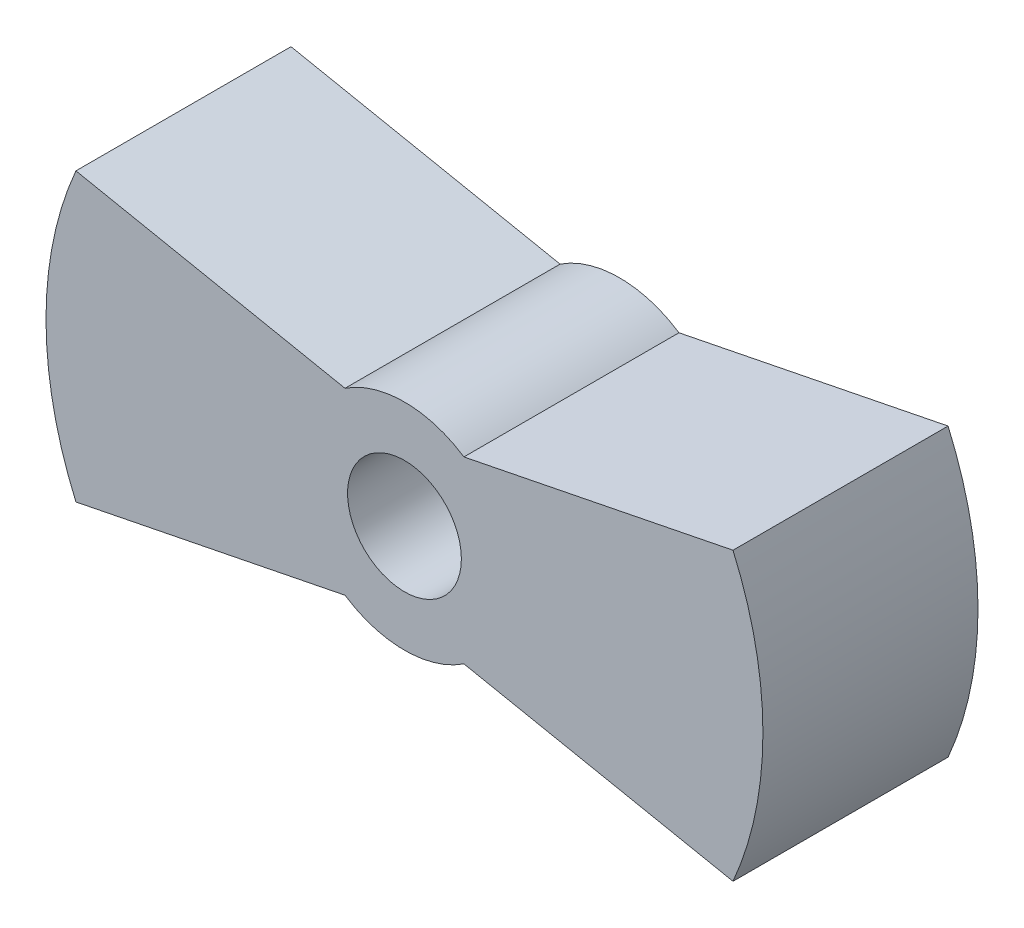
ISO-10303-21;
HEADER;
FILE_DESCRIPTION(('STEP AP214'),'2;1');
FILE_NAME('part.step','',(''),(''),'','','');
FILE_SCHEMA(('AUTOMOTIVE_DESIGN { 1 0 10303 214 1 1 1 1 }'));
ENDSEC;
DATA;
#1=APPLICATION_CONTEXT('core data for automotive mechanical design processes');
#2=APPLICATION_PROTOCOL_DEFINITION('international standard','automotive_design',2000,#1);
#3=PRODUCT_CONTEXT('',#1,'mechanical');
#4=PRODUCT('Part','Part','',(#3));
#5=PRODUCT_RELATED_PRODUCT_CATEGORY('part','',(#4));
#6=PRODUCT_DEFINITION_FORMATION('','',#4);
#7=PRODUCT_DEFINITION_CONTEXT('part definition',#1,'design');
#8=PRODUCT_DEFINITION('design','',#6,#7);
#9=PRODUCT_DEFINITION_SHAPE('','',#8);
#10=(LENGTH_UNIT() NAMED_UNIT(*) SI_UNIT(.MILLI.,.METRE.));
#11=(NAMED_UNIT(*) PLANE_ANGLE_UNIT() SI_UNIT($,.RADIAN.));
#12=(NAMED_UNIT(*) SI_UNIT($,.STERADIAN.) SOLID_ANGLE_UNIT());
#13=UNCERTAINTY_MEASURE_WITH_UNIT(LENGTH_MEASURE(1.E-05),#10,'distance_accuracy_value','');
#14=(GEOMETRIC_REPRESENTATION_CONTEXT(3) GLOBAL_UNCERTAINTY_ASSIGNED_CONTEXT((#13)) GLOBAL_UNIT_ASSIGNED_CONTEXT((#10,
#11,#12)) REPRESENTATION_CONTEXT('',''));
#15=CARTESIAN_POINT('',(0.,0.,0.));
#16=DIRECTION('',(0.,0.,1.));
#17=DIRECTION('',(1.,0.,0.));
#18=AXIS2_PLACEMENT_3D('',#15,#16,#17);
#19=CARTESIAN_POINT('',(0.416695336637559,2.08537653466309,6.));
#20=DIRECTION('',(-0.195944329277329,-0.980615021210698,0.));
#21=DIRECTION('',(0.980615021210698,-0.195944329277329,0.));
#22=AXIS2_PLACEMENT_3D('',#19,#20,#21);
#23=PLANE('',#22);
#24=DIRECTION('',(-0.980615021210698,0.195944329277329,0.));
#25=VECTOR('',#24,1.);
#26=CARTESIAN_POINT('',(0.416695336637559,2.08537653466309,0.));
#27=LINE('',#26,#25);
#28=CARTESIAN_POINT('',(-1.6583123951777,2.5,0.));
#29=VERTEX_POINT('',#28);
#30=CARTESIAN_POINT('',(-9.16515138991168,4.,0.));
#31=VERTEX_POINT('',#30);
#32=EDGE_CURVE('E144',#29,#31,#27,.T.);
#33=ORIENTED_EDGE('',*,*,#32,.T.);
#34=DIRECTION('',(0.,0.,-1.));
#35=VECTOR('',#34,1.);
#36=CARTESIAN_POINT('',(-9.16515138991168,4.,6.));
#37=LINE('',#36,#35);
#38=CARTESIAN_POINT('',(-9.16515138991168,4.,6.));
#39=VERTEX_POINT('',#38);
#40=EDGE_CURVE('E11',#39,#31,#37,.T.);
#41=ORIENTED_EDGE('',*,*,#40,.F.);
#42=DIRECTION('',(-0.980615021210698,0.195944329277329,0.));
#43=VECTOR('',#42,1.);
#44=CARTESIAN_POINT('',(0.416695336637559,2.08537653466309,6.));
#45=LINE('',#44,#43);
#46=CARTESIAN_POINT('',(-1.6583123951777,2.5,6.));
#47=VERTEX_POINT('',#46);
#48=EDGE_CURVE('E164',#47,#39,#45,.T.);
#49=ORIENTED_EDGE('',*,*,#48,.F.);
#50=DIRECTION('',(0.,0.,-1.));
#51=VECTOR('',#50,1.);
#52=CARTESIAN_POINT('',(-1.6583123951777,2.5,6.));
#53=LINE('',#52,#51);
#54=EDGE_CURVE('E143',#47,#29,#53,.T.);
#55=ORIENTED_EDGE('',*,*,#54,.T.);
#56=EDGE_LOOP('',(#33,#41,#49,#55));
#57=FACE_BOUND('',#56,.T.);
#58=ADVANCED_FACE('F40',(#57),#23,.F.);
#59=CARTESIAN_POINT('',(0.,0.,6.));
#60=DIRECTION('',(0.,0.,-1.));
#61=DIRECTION('',(-1.,0.,0.));
#62=AXIS2_PLACEMENT_3D('',#59,#60,#61);
#63=CYLINDRICAL_SURFACE('',#62,10.);
#64=CARTESIAN_POINT('',(0.,0.,0.));
#65=DIRECTION('',(0.,0.,1.));
#66=DIRECTION('',(1.,0.,0.));
#67=AXIS2_PLACEMENT_3D('',#64,#65,#66);
#68=CIRCLE('',#67,10.);
#69=CARTESIAN_POINT('',(-9.16515138991168,-4.,0.));
#70=VERTEX_POINT('',#69);
#71=EDGE_CURVE('E147',#31,#70,#68,.T.);
#72=ORIENTED_EDGE('',*,*,#71,.T.);
#73=DIRECTION('',(0.,0.,-1.));
#74=VECTOR('',#73,1.);
#75=CARTESIAN_POINT('',(-9.16515138991168,-4.,6.));
#76=LINE('',#75,#74);
#77=CARTESIAN_POINT('',(-9.16515138991168,-4.,6.));
#78=VERTEX_POINT('',#77);
#79=EDGE_CURVE('E48',#78,#70,#76,.T.);
#80=ORIENTED_EDGE('',*,*,#79,.F.);
#81=CARTESIAN_POINT('',(0.,0.,6.));
#82=DIRECTION('',(0.,0.,1.));
#83=DIRECTION('',(1.,0.,0.));
#84=AXIS2_PLACEMENT_3D('',#81,#82,#83);
#85=CIRCLE('',#84,10.);
#86=EDGE_CURVE('E96',#39,#78,#85,.T.);
#87=ORIENTED_EDGE('',*,*,#86,.F.);
#88=ORIENTED_EDGE('',*,*,#40,.T.);
#89=EDGE_LOOP('',(#72,#80,#87,#88));
#90=FACE_BOUND('',#89,.T.);
#91=ADVANCED_FACE('F178',(#90),#63,.T.);
#92=CARTESIAN_POINT('',(0.416695336637559,-2.08537653466309,6.));
#93=DIRECTION('',(0.195944329277329,-0.980615021210698,0.));
#94=DIRECTION('',(0.980615021210698,0.195944329277329,0.));
#95=AXIS2_PLACEMENT_3D('',#92,#93,#94);
#96=PLANE('',#95);
#97=DIRECTION('',(-0.980615021210698,-0.195944329277329,0.));
#98=VECTOR('',#97,1.);
#99=CARTESIAN_POINT('',(0.416695336637559,-2.08537653466309,0.));
#100=LINE('',#99,#98);
#101=CARTESIAN_POINT('',(-1.6583123951777,-2.5,0.));
#102=VERTEX_POINT('',#101);
#103=EDGE_CURVE('E151',#102,#70,#100,.T.);
#104=ORIENTED_EDGE('',*,*,#103,.F.);
#105=DIRECTION('',(0.,0.,-1.));
#106=VECTOR('',#105,1.);
#107=CARTESIAN_POINT('',(-1.6583123951777,-2.5,6.));
#108=LINE('',#107,#106);
#109=CARTESIAN_POINT('',(-1.6583123951777,-2.5,6.));
#110=VERTEX_POINT('',#109);
#111=EDGE_CURVE('E171',#110,#102,#108,.T.);
#112=ORIENTED_EDGE('',*,*,#111,.F.);
#113=DIRECTION('',(-0.980615021210698,-0.195944329277329,0.));
#114=VECTOR('',#113,1.);
#115=CARTESIAN_POINT('',(0.416695336637559,-2.08537653466309,6.));
#116=LINE('',#115,#114);
#117=EDGE_CURVE('E177',#110,#78,#116,.T.);
#118=ORIENTED_EDGE('',*,*,#117,.T.);
#119=ORIENTED_EDGE('',*,*,#79,.T.);
#120=EDGE_LOOP('',(#104,#112,#118,#119));
#121=FACE_BOUND('',#120,.T.);
#122=ADVANCED_FACE('F175',(#121),#96,.T.);
#123=CARTESIAN_POINT('',(0.,0.,6.));
#124=DIRECTION('',(0.,0.,-1.));
#125=DIRECTION('',(-1.,0.,0.));
#126=AXIS2_PLACEMENT_3D('',#123,#124,#125);
#127=CYLINDRICAL_SURFACE('',#126,3.);
#128=CARTESIAN_POINT('',(0.,0.,0.));
#129=DIRECTION('',(0.,0.,1.));
#130=DIRECTION('',(1.,0.,0.));
#131=AXIS2_PLACEMENT_3D('',#128,#129,#130);
#132=CIRCLE('',#131,3.);
#133=CARTESIAN_POINT('',(1.6583123951777,-2.5,0.));
#134=VERTEX_POINT('',#133);
#135=EDGE_CURVE('E154',#102,#134,#132,.T.);
#136=ORIENTED_EDGE('',*,*,#135,.T.);
#137=DIRECTION('',(0.,0.,-1.));
#138=VECTOR('',#137,1.);
#139=CARTESIAN_POINT('',(1.6583123951777,-2.5,6.));
#140=LINE('',#139,#138);
#141=CARTESIAN_POINT('',(1.6583123951777,-2.5,6.));
#142=VERTEX_POINT('',#141);
#143=EDGE_CURVE('E168',#142,#134,#140,.T.);
#144=ORIENTED_EDGE('',*,*,#143,.F.);
#145=CARTESIAN_POINT('',(0.,0.,6.));
#146=DIRECTION('',(0.,0.,1.));
#147=DIRECTION('',(1.,0.,0.));
#148=AXIS2_PLACEMENT_3D('',#145,#146,#147);
#149=CIRCLE('',#148,3.);
#150=EDGE_CURVE('E138',#110,#142,#149,.T.);
#151=ORIENTED_EDGE('',*,*,#150,.F.);
#152=ORIENTED_EDGE('',*,*,#111,.T.);
#153=EDGE_LOOP('',(#136,#144,#151,#152));
#154=FACE_BOUND('',#153,.T.);
#155=ADVANCED_FACE('F188',(#154),#127,.T.);
#156=CARTESIAN_POINT('',(-0.416695336637559,-2.08537653466309,6.));
#157=DIRECTION('',(0.195944329277329,0.980615021210698,0.));
#158=DIRECTION('',(-0.980615021210698,0.195944329277329,0.));
#159=AXIS2_PLACEMENT_3D('',#156,#157,#158);
#160=PLANE('',#159);
#161=DIRECTION('',(0.980615021210698,-0.195944329277329,0.));
#162=VECTOR('',#161,1.);
#163=CARTESIAN_POINT('',(-0.416695336637559,-2.08537653466309,0.));
#164=LINE('',#163,#162);
#165=CARTESIAN_POINT('',(9.16515138991168,-4.,0.));
#166=VERTEX_POINT('',#165);
#167=EDGE_CURVE('E156',#134,#166,#164,.T.);
#168=ORIENTED_EDGE('',*,*,#167,.T.);
#169=DIRECTION('',(0.,0.,-1.));
#170=VECTOR('',#169,1.);
#171=CARTESIAN_POINT('',(9.16515138991168,-4.,6.));
#172=LINE('',#171,#170);
#173=CARTESIAN_POINT('',(9.16515138991168,-4.,6.));
#174=VERTEX_POINT('',#173);
#175=EDGE_CURVE('E132',#174,#166,#172,.T.);
#176=ORIENTED_EDGE('',*,*,#175,.F.);
#177=DIRECTION('',(0.980615021210698,-0.195944329277329,0.));
#178=VECTOR('',#177,1.);
#179=CARTESIAN_POINT('',(-0.416695336637559,-2.08537653466309,6.));
#180=LINE('',#179,#178);
#181=EDGE_CURVE('E119',#142,#174,#180,.T.);
#182=ORIENTED_EDGE('',*,*,#181,.F.);
#183=ORIENTED_EDGE('',*,*,#143,.T.);
#184=EDGE_LOOP('',(#168,#176,#182,#183));
#185=FACE_BOUND('',#184,.T.);
#186=ADVANCED_FACE('F191',(#185),#160,.F.);
#187=CARTESIAN_POINT('',(0.,0.,6.));
#188=DIRECTION('',(0.,0.,-1.));
#189=DIRECTION('',(-1.,0.,0.));
#190=AXIS2_PLACEMENT_3D('',#187,#188,#189);
#191=CYLINDRICAL_SURFACE('',#190,10.);
#192=CARTESIAN_POINT('',(0.,0.,0.));
#193=DIRECTION('',(0.,0.,1.));
#194=DIRECTION('',(1.,0.,0.));
#195=AXIS2_PLACEMENT_3D('',#192,#193,#194);
#196=CIRCLE('',#195,10.);
#197=CARTESIAN_POINT('',(9.16515138991168,4.,0.));
#198=VERTEX_POINT('',#197);
#199=EDGE_CURVE('E128',#166,#198,#196,.T.);
#200=ORIENTED_EDGE('',*,*,#199,.T.);
#201=DIRECTION('',(0.,0.,-1.));
#202=VECTOR('',#201,1.);
#203=CARTESIAN_POINT('',(9.16515138991168,4.,6.));
#204=LINE('',#203,#202);
#205=CARTESIAN_POINT('',(9.16515138991168,4.,6.));
#206=VERTEX_POINT('',#205);
#207=EDGE_CURVE('E125',#206,#198,#204,.T.);
#208=ORIENTED_EDGE('',*,*,#207,.F.);
#209=CARTESIAN_POINT('',(0.,0.,6.));
#210=DIRECTION('',(0.,0.,1.));
#211=DIRECTION('',(1.,0.,0.));
#212=AXIS2_PLACEMENT_3D('',#209,#210,#211);
#213=CIRCLE('',#212,10.);
#214=EDGE_CURVE('E112',#174,#206,#213,.T.);
#215=ORIENTED_EDGE('',*,*,#214,.F.);
#216=ORIENTED_EDGE('',*,*,#175,.T.);
#217=EDGE_LOOP('',(#200,#208,#215,#216));
#218=FACE_BOUND('',#217,.T.);
#219=ADVANCED_FACE('F126',(#218),#191,.T.);
#220=CARTESIAN_POINT('',(-0.416695336637559,2.08537653466309,6.));
#221=DIRECTION('',(-0.195944329277329,0.980615021210698,0.));
#222=DIRECTION('',(-0.980615021210698,-0.195944329277329,0.));
#223=AXIS2_PLACEMENT_3D('',#220,#221,#222);
#224=PLANE('',#223);
#225=DIRECTION('',(0.980615021210698,0.195944329277329,0.));
#226=VECTOR('',#225,1.);
#227=CARTESIAN_POINT('',(-0.416695336637559,2.08537653466309,0.));
#228=LINE('',#227,#226);
#229=CARTESIAN_POINT('',(1.6583123951777,2.5,0.));
#230=VERTEX_POINT('',#229);
#231=EDGE_CURVE('E159',#230,#198,#228,.T.);
#232=ORIENTED_EDGE('',*,*,#231,.F.);
#233=DIRECTION('',(0.,0.,-1.));
#234=VECTOR('',#233,1.);
#235=CARTESIAN_POINT('',(1.6583123951777,2.5,6.));
#236=LINE('',#235,#234);
#237=CARTESIAN_POINT('',(1.6583123951777,2.5,6.));
#238=VERTEX_POINT('',#237);
#239=EDGE_CURVE('E85',#238,#230,#236,.T.);
#240=ORIENTED_EDGE('',*,*,#239,.F.);
#241=DIRECTION('',(0.980615021210698,0.195944329277329,0.));
#242=VECTOR('',#241,1.);
#243=CARTESIAN_POINT('',(-0.416695336637559,2.08537653466309,6.));
#244=LINE('',#243,#242);
#245=EDGE_CURVE('E117',#238,#206,#244,.T.);
#246=ORIENTED_EDGE('',*,*,#245,.T.);
#247=ORIENTED_EDGE('',*,*,#207,.T.);
#248=EDGE_LOOP('',(#232,#240,#246,#247));
#249=FACE_BOUND('',#248,.T.);
#250=ADVANCED_FACE('F134',(#249),#224,.T.);
#251=EDGE_CURVE('E88',#230,#29,#132,.T.);
#252=ORIENTED_EDGE('',*,*,#251,.T.);
#253=ORIENTED_EDGE('',*,*,#54,.F.);
#254=EDGE_CURVE('E56',#238,#47,#149,.T.);
#255=ORIENTED_EDGE('',*,*,#254,.F.);
#256=ORIENTED_EDGE('',*,*,#239,.T.);
#257=EDGE_LOOP('',(#252,#253,#255,#256));
#258=FACE_BOUND('',#257,.T.);
#259=ADVANCED_FACE('F410',(#258),#127,.T.);
#260=CARTESIAN_POINT('',(0.,0.,6.));
#261=DIRECTION('',(0.,0.,-1.));
#262=DIRECTION('',(-1.,0.,0.));
#263=AXIS2_PLACEMENT_3D('',#260,#261,#262);
#264=CYLINDRICAL_SURFACE('',#263,1.5875);
#265=CARTESIAN_POINT('',(0.,0.,6.));
#266=DIRECTION('',(0.,0.,1.));
#267=DIRECTION('',(1.,0.,0.));
#268=AXIS2_PLACEMENT_3D('',#265,#266,#267);
#269=CIRCLE('',#268,1.5875);
#270=CARTESIAN_POINT('',(1.5875,0.,6.));
#271=VERTEX_POINT('',#270);
#272=EDGE_CURVE('E136',#271,#271,#269,.T.);
#273=ORIENTED_EDGE('',*,*,#272,.T.);
#274=EDGE_LOOP('',(#273));
#275=FACE_BOUND('',#274,.T.);
#276=CARTESIAN_POINT('',(0.,0.,0.));
#277=DIRECTION('',(0.,0.,1.));
#278=DIRECTION('',(1.,0.,0.));
#279=AXIS2_PLACEMENT_3D('',#276,#277,#278);
#280=CIRCLE('',#279,1.5875);
#281=CARTESIAN_POINT('',(1.5875,0.,0.));
#282=VERTEX_POINT('',#281);
#283=EDGE_CURVE('E161',#282,#282,#280,.T.);
#284=ORIENTED_EDGE('',*,*,#283,.F.);
#285=EDGE_LOOP('',(#284));
#286=FACE_BOUND('',#285,.T.);
#287=ADVANCED_FACE('F399',(#275,#286),#264,.F.);
#288=CARTESIAN_POINT('',(0.,0.,6.));
#289=DIRECTION('',(0.,0.,1.));
#290=DIRECTION('',(1.,0.,0.));
#291=AXIS2_PLACEMENT_3D('',#288,#289,#290);
#292=PLANE('',#291);
#293=ORIENTED_EDGE('',*,*,#48,.T.);
#294=ORIENTED_EDGE('',*,*,#86,.T.);
#295=ORIENTED_EDGE('',*,*,#117,.F.);
#296=ORIENTED_EDGE('',*,*,#150,.T.);
#297=ORIENTED_EDGE('',*,*,#181,.T.);
#298=ORIENTED_EDGE('',*,*,#214,.T.);
#299=ORIENTED_EDGE('',*,*,#245,.F.);
#300=ORIENTED_EDGE('',*,*,#254,.T.);
#301=EDGE_LOOP('',(#293,#294,#295,#296,#297,#298,#299,#300));
#302=FACE_BOUND('',#301,.T.);
#303=ORIENTED_EDGE('',*,*,#272,.F.);
#304=EDGE_LOOP('',(#303));
#305=FACE_BOUND('',#304,.T.);
#306=ADVANCED_FACE('F114',(#302,#305),#292,.T.);
#307=CARTESIAN_POINT('',(0.,0.,0.));
#308=DIRECTION('',(0.,0.,1.));
#309=DIRECTION('',(1.,0.,0.));
#310=AXIS2_PLACEMENT_3D('',#307,#308,#309);
#311=PLANE('',#310);
#312=ORIENTED_EDGE('',*,*,#32,.F.);
#313=ORIENTED_EDGE('',*,*,#251,.F.);
#314=ORIENTED_EDGE('',*,*,#231,.T.);
#315=ORIENTED_EDGE('',*,*,#199,.F.);
#316=ORIENTED_EDGE('',*,*,#167,.F.);
#317=ORIENTED_EDGE('',*,*,#135,.F.);
#318=ORIENTED_EDGE('',*,*,#103,.T.);
#319=ORIENTED_EDGE('',*,*,#71,.F.);
#320=EDGE_LOOP('',(#312,#313,#314,#315,#316,#317,#318,#319));
#321=FACE_BOUND('',#320,.T.);
#322=ORIENTED_EDGE('',*,*,#283,.T.);
#323=EDGE_LOOP('',(#322));
#324=FACE_BOUND('',#323,.T.);
#325=ADVANCED_FACE('F183',(#321,#324),#311,.F.);
#326=CLOSED_SHELL('',(#58,#91,#122,#155,#186,#219,#250,#259,#287,#306,#325));
#327=CARTESIAN_POINT('',(6.9,0.,3.));
#328=DIRECTION('',(1.,0.,0.));
#329=DIRECTION('',(0.,0.,-1.));
#330=AXIS2_PLACEMENT_3D('',#327,#328,#329);
#331=CYLINDRICAL_SURFACE('',#330,2.1);
#332=CARTESIAN_POINT('',(9.,0.,3.));
#333=DIRECTION('',(1.,0.,0.));
#334=DIRECTION('',(0.,0.,-1.));
#335=AXIS2_PLACEMENT_3D('',#332,#333,#334);
#336=CIRCLE('',#335,2.1);
#337=CARTESIAN_POINT('',(9.,-2.1,3.));
#338=VERTEX_POINT('',#337);
#339=CARTESIAN_POINT('',(9.,2.1,3.));
#340=VERTEX_POINT('',#339);
#341=EDGE_CURVE('E218',#338,#340,#336,.T.);
#342=ORIENTED_EDGE('',*,*,#341,.T.);
#343=DIRECTION('',(1.,0.,0.));
#344=VECTOR('',#343,1.);
#345=CARTESIAN_POINT('',(6.9,2.1,3.));
#346=LINE('',#345,#344);
#347=CARTESIAN_POINT('',(6.9,2.1,3.));
#348=VERTEX_POINT('',#347);
#349=EDGE_CURVE('E196',#348,#340,#346,.T.);
#350=ORIENTED_EDGE('',*,*,#349,.F.);
#351=CARTESIAN_POINT('',(6.9,0.,3.));
#352=DIRECTION('',(1.,0.,0.));
#353=DIRECTION('',(0.,0.,-1.));
#354=AXIS2_PLACEMENT_3D('',#351,#352,#353);
#355=CIRCLE('',#354,2.1);
#356=CARTESIAN_POINT('',(6.9,-2.1,3.));
#357=VERTEX_POINT('',#356);
#358=EDGE_CURVE('E211',#357,#348,#355,.T.);
#359=ORIENTED_EDGE('',*,*,#358,.F.);
#360=DIRECTION('',(1.,0.,0.));
#361=VECTOR('',#360,1.);
#362=CARTESIAN_POINT('',(6.9,-2.1,3.));
#363=LINE('',#362,#361);
#364=EDGE_CURVE('E148',#357,#338,#363,.T.);
#365=ORIENTED_EDGE('',*,*,#364,.T.);
#366=EDGE_LOOP('',(#342,#350,#359,#365));
#367=FACE_BOUND('',#366,.T.);
#368=ADVANCED_FACE('F315',(#367),#331,.F.);
#369=CARTESIAN_POINT('',(6.9,-2.1,5.1));
#370=DIRECTION('',(0.,-1.,0.));
#371=DIRECTION('',(0.,0.,-1.));
#372=AXIS2_PLACEMENT_3D('',#369,#370,#371);
#373=PLANE('',#372);
#374=DIRECTION('',(0.,0.,-1.));
#375=VECTOR('',#374,1.);
#376=CARTESIAN_POINT('',(9.,-2.1,5.1));
#377=LINE('',#376,#375);
#378=CARTESIAN_POINT('',(9.,-2.1,5.1));
#379=VERTEX_POINT('',#378);
#380=EDGE_CURVE('E208',#379,#338,#377,.T.);
#381=ORIENTED_EDGE('',*,*,#380,.T.);
#382=ORIENTED_EDGE('',*,*,#364,.F.);
#383=DIRECTION('',(0.,0.,-1.));
#384=VECTOR('',#383,1.);
#385=CARTESIAN_POINT('',(6.9,-2.1,5.1));
#386=LINE('',#385,#384);
#387=CARTESIAN_POINT('',(6.9,-2.1,5.1));
#388=VERTEX_POINT('',#387);
#389=EDGE_CURVE('E200',#388,#357,#386,.T.);
#390=ORIENTED_EDGE('',*,*,#389,.F.);
#391=DIRECTION('',(1.,0.,0.));
#392=VECTOR('',#391,1.);
#393=CARTESIAN_POINT('',(6.9,-2.1,5.1));
#394=LINE('',#393,#392);
#395=EDGE_CURVE('E203',#388,#379,#394,.T.);
#396=ORIENTED_EDGE('',*,*,#395,.T.);
#397=EDGE_LOOP('',(#381,#382,#390,#396));
#398=FACE_BOUND('',#397,.T.);
#399=ADVANCED_FACE('F321',(#398),#373,.F.);
#400=CARTESIAN_POINT('',(6.9,2.1,5.1));
#401=DIRECTION('',(0.,0.,1.));
#402=DIRECTION('',(1.,0.,0.));
#403=AXIS2_PLACEMENT_3D('',#400,#401,#402);
#404=PLANE('',#403);
#405=DIRECTION('',(0.,-1.,0.));
#406=VECTOR('',#405,1.);
#407=CARTESIAN_POINT('',(9.,2.1,5.1));
#408=LINE('',#407,#406);
#409=CARTESIAN_POINT('',(9.,2.1,5.1));
#410=VERTEX_POINT('',#409);
#411=EDGE_CURVE('E212',#410,#379,#408,.T.);
#412=ORIENTED_EDGE('',*,*,#411,.T.);
#413=ORIENTED_EDGE('',*,*,#395,.F.);
#414=DIRECTION('',(0.,-1.,0.));
#415=VECTOR('',#414,1.);
#416=CARTESIAN_POINT('',(6.9,2.1,5.1));
#417=LINE('',#416,#415);
#418=CARTESIAN_POINT('',(6.9,2.1,5.1));
#419=VERTEX_POINT('',#418);
#420=EDGE_CURVE('E224',#419,#388,#417,.T.);
#421=ORIENTED_EDGE('',*,*,#420,.F.);
#422=DIRECTION('',(1.,0.,0.));
#423=VECTOR('',#422,1.);
#424=CARTESIAN_POINT('',(6.9,2.1,5.1));
#425=LINE('',#424,#423);
#426=EDGE_CURVE('E199',#419,#410,#425,.T.);
#427=ORIENTED_EDGE('',*,*,#426,.T.);
#428=EDGE_LOOP('',(#412,#413,#421,#427));
#429=FACE_BOUND('',#428,.T.);
#430=ADVANCED_FACE('F323',(#429),#404,.F.);
#431=CARTESIAN_POINT('',(6.9,2.1,3.));
#432=DIRECTION('',(0.,1.,0.));
#433=DIRECTION('',(0.,0.,1.));
#434=AXIS2_PLACEMENT_3D('',#431,#432,#433);
#435=PLANE('',#434);
#436=DIRECTION('',(0.,0.,1.));
#437=VECTOR('',#436,1.);
#438=CARTESIAN_POINT('',(9.,2.1,3.));
#439=LINE('',#438,#437);
#440=EDGE_CURVE('E215',#340,#410,#439,.T.);
#441=ORIENTED_EDGE('',*,*,#440,.T.);
#442=ORIENTED_EDGE('',*,*,#426,.F.);
#443=DIRECTION('',(0.,0.,1.));
#444=VECTOR('',#443,1.);
#445=CARTESIAN_POINT('',(6.9,2.1,3.));
#446=LINE('',#445,#444);
#447=EDGE_CURVE('E227',#348,#419,#446,.T.);
#448=ORIENTED_EDGE('',*,*,#447,.F.);
#449=ORIENTED_EDGE('',*,*,#349,.T.);
#450=EDGE_LOOP('',(#441,#442,#448,#449));
#451=FACE_BOUND('',#450,.T.);
#452=ADVANCED_FACE('F330',(#451),#435,.F.);
#453=CARTESIAN_POINT('',(6.9,0.,3.));
#454=DIRECTION('',(1.,0.,0.));
#455=DIRECTION('',(0.,0.,-1.));
#456=AXIS2_PLACEMENT_3D('',#453,#454,#455);
#457=PLANE('',#456);
#458=ORIENTED_EDGE('',*,*,#358,.T.);
#459=ORIENTED_EDGE('',*,*,#447,.T.);
#460=ORIENTED_EDGE('',*,*,#420,.T.);
#461=ORIENTED_EDGE('',*,*,#389,.T.);
#462=EDGE_LOOP('',(#458,#459,#460,#461));
#463=FACE_BOUND('',#462,.T.);
#464=ADVANCED_FACE('F351',(#463),#457,.T.);
#465=CARTESIAN_POINT('',(9.,0.,3.));
#466=DIRECTION('',(1.,0.,0.));
#467=DIRECTION('',(0.,0.,-1.));
#468=AXIS2_PLACEMENT_3D('',#465,#466,#467);
#469=PLANE('',#468);
#470=ORIENTED_EDGE('',*,*,#341,.F.);
#471=ORIENTED_EDGE('',*,*,#380,.F.);
#472=ORIENTED_EDGE('',*,*,#411,.F.);
#473=ORIENTED_EDGE('',*,*,#440,.F.);
#474=EDGE_LOOP('',(#470,#471,#472,#473));
#475=FACE_BOUND('',#474,.T.);
#476=ADVANCED_FACE('F319',(#475),#469,.F.);
#477=CLOSED_SHELL('',(#368,#399,#430,#452,#464,#476));
#478=CARTESIAN_POINT('',(-6.9,0.,3.));
#479=DIRECTION('',(-1.,0.,0.));
#480=DIRECTION('',(0.,0.,1.));
#481=AXIS2_PLACEMENT_3D('',#478,#479,#480);
#482=CYLINDRICAL_SURFACE('',#481,2.1);
#483=CARTESIAN_POINT('',(-9.,0.,3.));
#484=DIRECTION('',(1.,0.,0.));
#485=DIRECTION('',(0.,0.,-1.));
#486=AXIS2_PLACEMENT_3D('',#483,#484,#485);
#487=CIRCLE('',#486,2.1);
#488=CARTESIAN_POINT('',(-9.,-2.1,3.));
#489=VERTEX_POINT('',#488);
#490=CARTESIAN_POINT('',(-9.,2.1,3.));
#491=VERTEX_POINT('',#490);
#492=EDGE_CURVE('E254',#489,#491,#487,.T.);
#493=ORIENTED_EDGE('',*,*,#492,.F.);
#494=DIRECTION('',(-1.,0.,0.));
#495=VECTOR('',#494,1.);
#496=CARTESIAN_POINT('',(-6.9,-2.1,3.));
#497=LINE('',#496,#495);
#498=CARTESIAN_POINT('',(-6.9,-2.1,3.));
#499=VERTEX_POINT('',#498);
#500=EDGE_CURVE('E232',#499,#489,#497,.T.);
#501=ORIENTED_EDGE('',*,*,#500,.F.);
#502=CARTESIAN_POINT('',(-6.9,0.,3.));
#503=DIRECTION('',(1.,0.,0.));
#504=DIRECTION('',(0.,0.,-1.));
#505=AXIS2_PLACEMENT_3D('',#502,#503,#504);
#506=CIRCLE('',#505,2.1);
#507=CARTESIAN_POINT('',(-6.9,2.1,3.));
#508=VERTEX_POINT('',#507);
#509=EDGE_CURVE('E247',#499,#508,#506,.T.);
#510=ORIENTED_EDGE('',*,*,#509,.T.);
#511=DIRECTION('',(-1.,0.,0.));
#512=VECTOR('',#511,1.);
#513=CARTESIAN_POINT('',(-6.9,2.1,3.));
#514=LINE('',#513,#512);
#515=EDGE_CURVE('E221',#508,#491,#514,.T.);
#516=ORIENTED_EDGE('',*,*,#515,.T.);
#517=EDGE_LOOP('',(#493,#501,#510,#516));
#518=FACE_BOUND('',#517,.T.);
#519=ADVANCED_FACE('F272',(#518),#482,.F.);
#520=CARTESIAN_POINT('',(-6.9,2.1,3.));
#521=DIRECTION('',(0.,-1.,0.));
#522=DIRECTION('',(0.,0.,-1.));
#523=AXIS2_PLACEMENT_3D('',#520,#521,#522);
#524=PLANE('',#523);
#525=DIRECTION('',(0.,0.,1.));
#526=VECTOR('',#525,1.);
#527=CARTESIAN_POINT('',(-9.,2.1,3.));
#528=LINE('',#527,#526);
#529=CARTESIAN_POINT('',(-9.,2.1,5.1));
#530=VERTEX_POINT('',#529);
#531=EDGE_CURVE('E244',#491,#530,#528,.T.);
#532=ORIENTED_EDGE('',*,*,#531,.F.);
#533=ORIENTED_EDGE('',*,*,#515,.F.);
#534=DIRECTION('',(0.,0.,1.));
#535=VECTOR('',#534,1.);
#536=CARTESIAN_POINT('',(-6.9,2.1,3.));
#537=LINE('',#536,#535);
#538=CARTESIAN_POINT('',(-6.9,2.1,5.1));
#539=VERTEX_POINT('',#538);
#540=EDGE_CURVE('E236',#508,#539,#537,.T.);
#541=ORIENTED_EDGE('',*,*,#540,.T.);
#542=DIRECTION('',(-1.,0.,0.));
#543=VECTOR('',#542,1.);
#544=CARTESIAN_POINT('',(-6.9,2.1,5.1));
#545=LINE('',#544,#543);
#546=EDGE_CURVE('E239',#539,#530,#545,.T.);
#547=ORIENTED_EDGE('',*,*,#546,.T.);
#548=EDGE_LOOP('',(#532,#533,#541,#547));
#549=FACE_BOUND('',#548,.T.);
#550=ADVANCED_FACE('F283',(#549),#524,.T.);
#551=CARTESIAN_POINT('',(-6.9,2.1,5.1));
#552=DIRECTION('',(0.,0.,-1.));
#553=DIRECTION('',(-1.,0.,0.));
#554=AXIS2_PLACEMENT_3D('',#551,#552,#553);
#555=PLANE('',#554);
#556=DIRECTION('',(0.,-1.,0.));
#557=VECTOR('',#556,1.);
#558=CARTESIAN_POINT('',(-9.,2.1,5.1));
#559=LINE('',#558,#557);
#560=CARTESIAN_POINT('',(-9.,-2.1,5.1));
#561=VERTEX_POINT('',#560);
#562=EDGE_CURVE('E248',#530,#561,#559,.T.);
#563=ORIENTED_EDGE('',*,*,#562,.F.);
#564=ORIENTED_EDGE('',*,*,#546,.F.);
#565=DIRECTION('',(0.,-1.,0.));
#566=VECTOR('',#565,1.);
#567=CARTESIAN_POINT('',(-6.9,2.1,5.1));
#568=LINE('',#567,#566);
#569=CARTESIAN_POINT('',(-6.9,-2.1,5.1));
#570=VERTEX_POINT('',#569);
#571=EDGE_CURVE('E259',#539,#570,#568,.T.);
#572=ORIENTED_EDGE('',*,*,#571,.T.);
#573=DIRECTION('',(-1.,0.,0.));
#574=VECTOR('',#573,1.);
#575=CARTESIAN_POINT('',(-6.9,-2.1,5.1));
#576=LINE('',#575,#574);
#577=EDGE_CURVE('E235',#570,#561,#576,.T.);
#578=ORIENTED_EDGE('',*,*,#577,.T.);
#579=EDGE_LOOP('',(#563,#564,#572,#578));
#580=FACE_BOUND('',#579,.T.);
#581=ADVANCED_FACE('F345',(#580),#555,.T.);
#582=CARTESIAN_POINT('',(-6.9,-2.1,5.1));
#583=DIRECTION('',(0.,1.,0.));
#584=DIRECTION('',(0.,0.,1.));
#585=AXIS2_PLACEMENT_3D('',#582,#583,#584);
#586=PLANE('',#585);
#587=DIRECTION('',(0.,0.,-1.));
#588=VECTOR('',#587,1.);
#589=CARTESIAN_POINT('',(-9.,-2.1,5.1));
#590=LINE('',#589,#588);
#591=EDGE_CURVE('E251',#561,#489,#590,.T.);
#592=ORIENTED_EDGE('',*,*,#591,.F.);
#593=ORIENTED_EDGE('',*,*,#577,.F.);
#594=DIRECTION('',(0.,0.,-1.));
#595=VECTOR('',#594,1.);
#596=CARTESIAN_POINT('',(-6.9,-2.1,5.1));
#597=LINE('',#596,#595);
#598=EDGE_CURVE('E262',#570,#499,#597,.T.);
#599=ORIENTED_EDGE('',*,*,#598,.T.);
#600=ORIENTED_EDGE('',*,*,#500,.T.);
#601=EDGE_LOOP('',(#592,#593,#599,#600));
#602=FACE_BOUND('',#601,.T.);
#603=ADVANCED_FACE('F349',(#602),#586,.T.);
#604=CARTESIAN_POINT('',(-6.9,0.,3.));
#605=DIRECTION('',(-1.,0.,0.));
#606=DIRECTION('',(0.,0.,-1.));
#607=AXIS2_PLACEMENT_3D('',#604,#605,#606);
#608=PLANE('',#607);
#609=ORIENTED_EDGE('',*,*,#509,.F.);
#610=ORIENTED_EDGE('',*,*,#598,.F.);
#611=ORIENTED_EDGE('',*,*,#571,.F.);
#612=ORIENTED_EDGE('',*,*,#540,.F.);
#613=EDGE_LOOP('',(#609,#610,#611,#612));
#614=FACE_BOUND('',#613,.T.);
#615=ADVANCED_FACE('F518',(#614),#608,.T.);
#616=CARTESIAN_POINT('',(-9.,0.,3.));
#617=DIRECTION('',(-1.,0.,0.));
#618=DIRECTION('',(0.,0.,-1.));
#619=AXIS2_PLACEMENT_3D('',#616,#617,#618);
#620=PLANE('',#619);
#621=ORIENTED_EDGE('',*,*,#492,.T.);
#622=ORIENTED_EDGE('',*,*,#531,.T.);
#623=ORIENTED_EDGE('',*,*,#562,.T.);
#624=ORIENTED_EDGE('',*,*,#591,.T.);
#625=EDGE_LOOP('',(#621,#622,#623,#624));
#626=FACE_BOUND('',#625,.T.);
#627=ADVANCED_FACE('F289',(#626),#620,.F.);
#628=CLOSED_SHELL('',(#519,#550,#581,#603,#615,#627));
#629=ORIENTED_CLOSED_SHELL('',*,#477,.T.);
#630=ORIENTED_CLOSED_SHELL('',*,#628,.T.);
#631=BREP_WITH_VOIDS('B2',#326,(#629,#630));
#632=ADVANCED_BREP_SHAPE_REPRESENTATION('',(#18,#631),#14);
#633=SHAPE_DEFINITION_REPRESENTATION(#9,#632);
ENDSEC;
END-ISO-10303-21;
